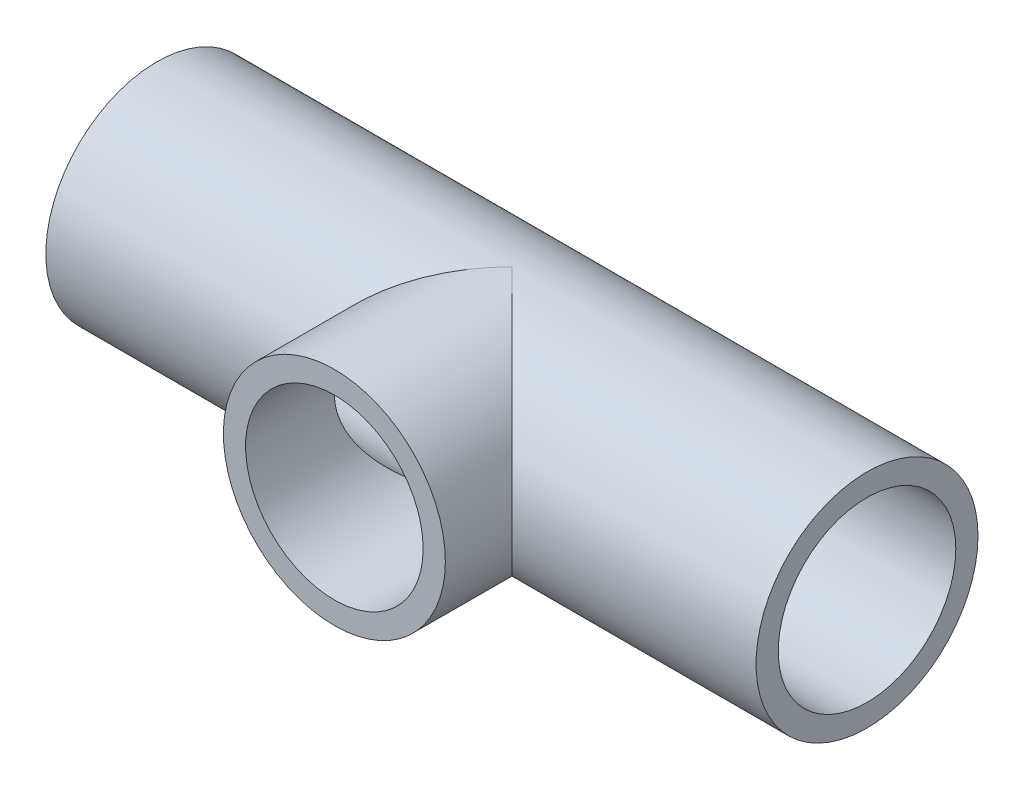
ISO-10303-21;
HEADER;
FILE_DESCRIPTION(('STEP AP214'),'2;1');
FILE_NAME('part.step','',(''),(''),'','','');
FILE_SCHEMA(('AUTOMOTIVE_DESIGN { 1 0 10303 214 1 1 1 1 }'));
ENDSEC;
DATA;
#1=APPLICATION_CONTEXT('core data for automotive mechanical design processes');
#2=APPLICATION_PROTOCOL_DEFINITION('international standard','automotive_design',2000,#1);
#3=PRODUCT_CONTEXT('',#1,'mechanical');
#4=PRODUCT('Part','Part','',(#3));
#5=PRODUCT_RELATED_PRODUCT_CATEGORY('part','',(#4));
#6=PRODUCT_DEFINITION_FORMATION('','',#4);
#7=PRODUCT_DEFINITION_CONTEXT('part definition',#1,'design');
#8=PRODUCT_DEFINITION('design','',#6,#7);
#9=PRODUCT_DEFINITION_SHAPE('','',#8);
#10=(LENGTH_UNIT() NAMED_UNIT(*) SI_UNIT(.MILLI.,.METRE.));
#11=(NAMED_UNIT(*) PLANE_ANGLE_UNIT() SI_UNIT($,.RADIAN.));
#12=(NAMED_UNIT(*) SI_UNIT($,.STERADIAN.) SOLID_ANGLE_UNIT());
#13=UNCERTAINTY_MEASURE_WITH_UNIT(LENGTH_MEASURE(1.E-05),#10,'distance_accuracy_value','');
#14=(GEOMETRIC_REPRESENTATION_CONTEXT(3) GLOBAL_UNCERTAINTY_ASSIGNED_CONTEXT((#13)) GLOBAL_UNIT_ASSIGNED_CONTEXT((#10,
#11,#12)) REPRESENTATION_CONTEXT('',''));
#15=CARTESIAN_POINT('',(0.,0.,0.));
#16=DIRECTION('',(0.,0.,1.));
#17=DIRECTION('',(1.,0.,0.));
#18=AXIS2_PLACEMENT_3D('',#15,#16,#17);
#19=CARTESIAN_POINT('',(0.,0.,12.7));
#20=DIRECTION('',(0.,0.,-1.));
#21=DIRECTION('',(-1.,0.,0.));
#22=AXIS2_PLACEMENT_3D('',#19,#20,#21);
#23=CYLINDRICAL_SURFACE('',#22,7.9375);
#24=CARTESIAN_POINT('',(0.,0.,12.7));
#25=DIRECTION('',(0.,0.,1.));
#26=DIRECTION('',(1.,0.,0.));
#27=AXIS2_PLACEMENT_3D('',#24,#25,#26);
#28=CIRCLE('',#27,7.9375);
#29=CARTESIAN_POINT('',(7.9375,0.,12.7));
#30=VERTEX_POINT('',#29);
#31=EDGE_CURVE('E11',#30,#30,#28,.T.);
#32=ORIENTED_EDGE('',*,*,#31,.F.);
#33=EDGE_LOOP('',(#32));
#34=FACE_BOUND('',#33,.T.);
#35=CARTESIAN_POINT('',(0.,0.,0.));
#36=DIRECTION('',(-0.707106781186547,0.,-0.707106781186547));
#37=DIRECTION('',(0.707106781186547,0.,-0.707106781186547));
#38=AXIS2_PLACEMENT_3D('',#35,#36,#37);
#39=ELLIPSE('',#38,11.2253201513364,7.9375);
#40=CARTESIAN_POINT('',(0.,-7.9375,0.));
#41=VERTEX_POINT('',#40);
#42=CARTESIAN_POINT('',(0.,7.9375,0.));
#43=VERTEX_POINT('',#42);
#44=EDGE_CURVE('E84',#41,#43,#39,.T.);
#45=ORIENTED_EDGE('',*,*,#44,.F.);
#46=CARTESIAN_POINT('',(0.,0.,0.));
#47=DIRECTION('',(0.707106781186547,0.,-0.707106781186547));
#48=DIRECTION('',(-0.707106781186547,0.,-0.707106781186547));
#49=AXIS2_PLACEMENT_3D('',#46,#47,#48);
#50=ELLIPSE('',#49,11.2253201513364,7.9375);
#51=EDGE_CURVE('E63',#43,#41,#50,.T.);
#52=ORIENTED_EDGE('',*,*,#51,.F.);
#53=EDGE_LOOP('',(#45,#52));
#54=FACE_BOUND('',#53,.T.);
#55=ADVANCED_FACE('F43',(#34,#54),#23,.T.);
#56=CARTESIAN_POINT('',(0.,0.,0.));
#57=DIRECTION('',(0.,0.,1.));
#58=DIRECTION('',(1.,0.,0.));
#59=AXIS2_PLACEMENT_3D('',#56,#57,#58);
#60=CYLINDRICAL_SURFACE('',#59,6.35);
#61=CARTESIAN_POINT('',(0.,0.,12.7));
#62=DIRECTION('',(0.,0.,1.));
#63=DIRECTION('',(1.,0.,0.));
#64=AXIS2_PLACEMENT_3D('',#61,#62,#63);
#65=CIRCLE('',#64,6.35);
#66=CARTESIAN_POINT('',(6.35,0.,12.7));
#67=VERTEX_POINT('',#66);
#68=EDGE_CURVE('E50',#67,#67,#65,.T.);
#69=ORIENTED_EDGE('',*,*,#68,.T.);
#70=EDGE_LOOP('',(#69));
#71=FACE_BOUND('',#70,.T.);
#72=CARTESIAN_POINT('',(0.,0.,0.));
#73=DIRECTION('',(-0.707106781186547,0.,0.707106781186547));
#74=DIRECTION('',(0.707106781186547,0.,0.707106781186547));
#75=AXIS2_PLACEMENT_3D('',#72,#73,#74);
#76=ELLIPSE('',#75,8.98025612106915,6.35);
#77=CARTESIAN_POINT('',(0.,6.35,0.));
#78=VERTEX_POINT('',#77);
#79=CARTESIAN_POINT('',(0.,-6.35,0.));
#80=VERTEX_POINT('',#79);
#81=EDGE_CURVE('E68',#78,#80,#76,.F.);
#82=ORIENTED_EDGE('',*,*,#81,.T.);
#83=CARTESIAN_POINT('',(0.,0.,0.));
#84=DIRECTION('',(0.707106781186547,0.,0.707106781186547));
#85=DIRECTION('',(-0.707106781186547,0.,0.707106781186547));
#86=AXIS2_PLACEMENT_3D('',#83,#84,#85);
#87=ELLIPSE('',#86,8.98025612106915,6.35);
#88=EDGE_CURVE('E56',#80,#78,#87,.F.);
#89=ORIENTED_EDGE('',*,*,#88,.T.);
#90=EDGE_LOOP('',(#82,#89));
#91=FACE_BOUND('',#90,.T.);
#92=ADVANCED_FACE('F73',(#71,#91),#60,.F.);
#93=CARTESIAN_POINT('',(0.,0.,12.7));
#94=DIRECTION('',(0.,0.,1.));
#95=DIRECTION('',(1.,0.,0.));
#96=AXIS2_PLACEMENT_3D('',#93,#94,#95);
#97=PLANE('',#96);
#98=ORIENTED_EDGE('',*,*,#68,.F.);
#99=EDGE_LOOP('',(#98));
#100=FACE_BOUND('',#99,.T.);
#101=ORIENTED_EDGE('',*,*,#31,.T.);
#102=EDGE_LOOP('',(#101));
#103=FACE_BOUND('',#102,.T.);
#104=ADVANCED_FACE('F89',(#100,#103),#97,.T.);
#105=CARTESIAN_POINT('',(25.4,0.,0.));
#106=DIRECTION('',(-1.,0.,0.));
#107=DIRECTION('',(0.,0.,1.));
#108=AXIS2_PLACEMENT_3D('',#105,#106,#107);
#109=CYLINDRICAL_SURFACE('',#108,7.9375);
#110=CARTESIAN_POINT('',(-25.4,0.,0.));
#111=DIRECTION('',(1.,0.,0.));
#112=DIRECTION('',(0.,0.,-1.));
#113=AXIS2_PLACEMENT_3D('',#110,#111,#112);
#114=CIRCLE('',#113,7.9375);
#115=CARTESIAN_POINT('',(-25.4,0.,-7.9375));
#116=VERTEX_POINT('',#115);
#117=EDGE_CURVE('E74',#116,#116,#114,.T.);
#118=ORIENTED_EDGE('',*,*,#117,.T.);
#119=EDGE_LOOP('',(#118));
#120=FACE_BOUND('',#119,.T.);
#121=CARTESIAN_POINT('',(25.4,0.,0.));
#122=DIRECTION('',(1.,0.,0.));
#123=DIRECTION('',(0.,0.,-1.));
#124=AXIS2_PLACEMENT_3D('',#121,#122,#123);
#125=CIRCLE('',#124,7.9375);
#126=CARTESIAN_POINT('',(25.4,0.,-7.9375));
#127=VERTEX_POINT('',#126);
#128=EDGE_CURVE('E77',#127,#127,#125,.T.);
#129=ORIENTED_EDGE('',*,*,#128,.F.);
#130=EDGE_LOOP('',(#129));
#131=FACE_BOUND('',#130,.T.);
#132=ORIENTED_EDGE('',*,*,#51,.T.);
#133=ORIENTED_EDGE('',*,*,#44,.T.);
#134=EDGE_LOOP('',(#132,#133));
#135=FACE_BOUND('',#134,.T.);
#136=ADVANCED_FACE('F92',(#120,#131,#135),#109,.T.);
#137=CARTESIAN_POINT('',(25.4,0.,0.));
#138=DIRECTION('',(1.,0.,0.));
#139=DIRECTION('',(0.,0.,-1.));
#140=AXIS2_PLACEMENT_3D('',#137,#138,#139);
#141=PLANE('',#140);
#142=CARTESIAN_POINT('',(25.4,0.,0.));
#143=DIRECTION('',(1.,0.,0.));
#144=DIRECTION('',(0.,0.,-1.));
#145=AXIS2_PLACEMENT_3D('',#142,#143,#144);
#146=CIRCLE('',#145,6.35);
#147=CARTESIAN_POINT('',(25.4,0.,-6.35));
#148=VERTEX_POINT('',#147);
#149=EDGE_CURVE('E138',#148,#148,#146,.T.);
#150=ORIENTED_EDGE('',*,*,#149,.F.);
#151=EDGE_LOOP('',(#150));
#152=FACE_BOUND('',#151,.T.);
#153=ORIENTED_EDGE('',*,*,#128,.T.);
#154=EDGE_LOOP('',(#153));
#155=FACE_BOUND('',#154,.T.);
#156=ADVANCED_FACE('F98',(#152,#155),#141,.T.);
#157=CARTESIAN_POINT('',(-25.4,0.,0.));
#158=DIRECTION('',(1.,0.,0.));
#159=DIRECTION('',(0.,0.,-1.));
#160=AXIS2_PLACEMENT_3D('',#157,#158,#159);
#161=PLANE('',#160);
#162=CARTESIAN_POINT('',(-25.4,0.,0.));
#163=DIRECTION('',(1.,0.,0.));
#164=DIRECTION('',(0.,0.,-1.));
#165=AXIS2_PLACEMENT_3D('',#162,#163,#164);
#166=CIRCLE('',#165,6.35);
#167=CARTESIAN_POINT('',(-25.4,0.,-6.35));
#168=VERTEX_POINT('',#167);
#169=EDGE_CURVE('E71',#168,#168,#166,.T.);
#170=ORIENTED_EDGE('',*,*,#169,.T.);
#171=EDGE_LOOP('',(#170));
#172=FACE_BOUND('',#171,.T.);
#173=ORIENTED_EDGE('',*,*,#117,.F.);
#174=EDGE_LOOP('',(#173));
#175=FACE_BOUND('',#174,.T.);
#176=ADVANCED_FACE('F105',(#172,#175),#161,.F.);
#177=CARTESIAN_POINT('',(-25.4,0.,0.));
#178=DIRECTION('',(1.,0.,0.));
#179=DIRECTION('',(0.,0.,-1.));
#180=AXIS2_PLACEMENT_3D('',#177,#178,#179);
#181=CYLINDRICAL_SURFACE('',#180,6.35);
#182=ORIENTED_EDGE('',*,*,#169,.F.);
#183=EDGE_LOOP('',(#182));
#184=FACE_BOUND('',#183,.T.);
#185=ORIENTED_EDGE('',*,*,#149,.T.);
#186=EDGE_LOOP('',(#185));
#187=FACE_BOUND('',#186,.T.);
#188=ORIENTED_EDGE('',*,*,#81,.F.);
#189=ORIENTED_EDGE('',*,*,#88,.F.);
#190=EDGE_LOOP('',(#188,#189));
#191=FACE_BOUND('',#190,.T.);
#192=ADVANCED_FACE('F69',(#184,#187,#191),#181,.F.);
#193=CLOSED_SHELL('',(#55,#92,#104,#136,#156,#176,#192));
#194=MANIFOLD_SOLID_BREP('B2',#193);
#195=ADVANCED_BREP_SHAPE_REPRESENTATION('',(#18,#194),#14);
#196=SHAPE_DEFINITION_REPRESENTATION(#9,#195);
ENDSEC;
END-ISO-10303-21;
